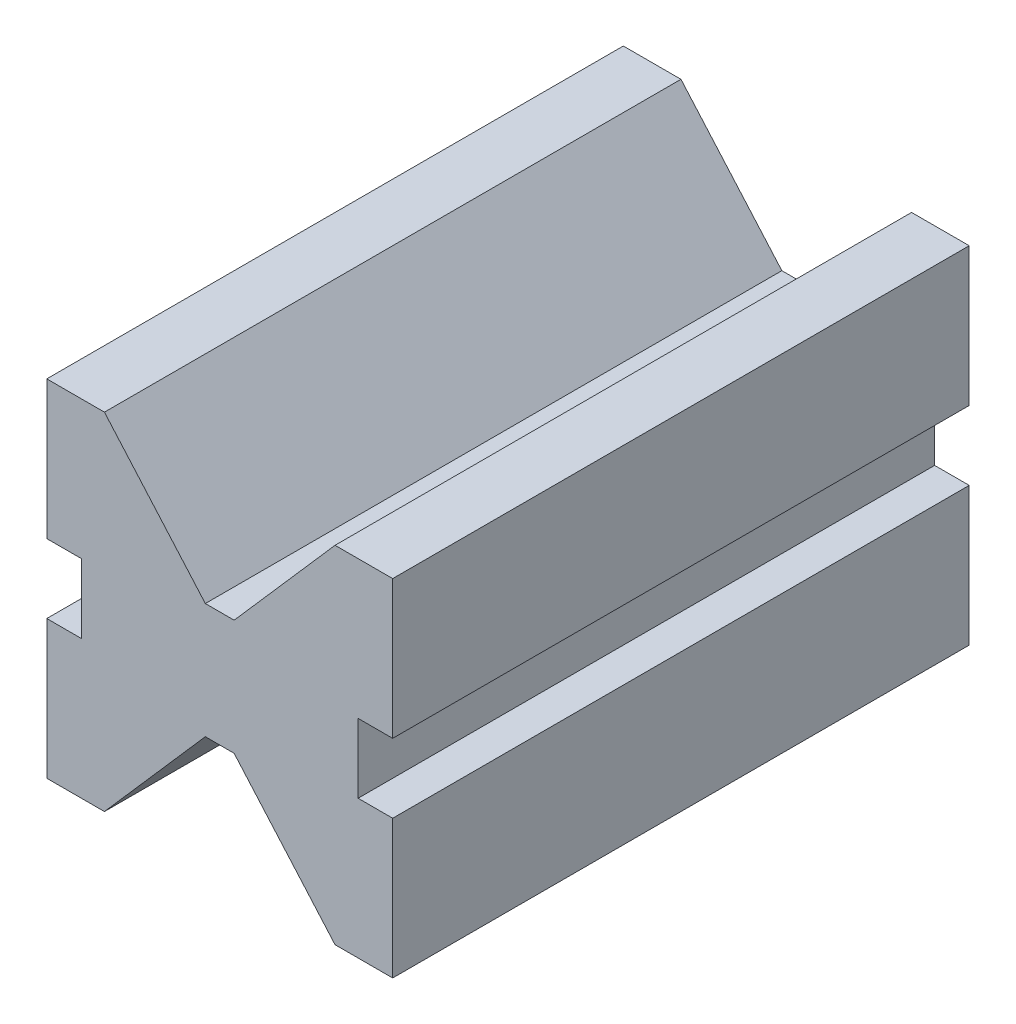
ISO-10303-21;
HEADER;
FILE_DESCRIPTION(('STEP AP214'),'2;1');
FILE_NAME('part.step','',(''),(''),'','','');
FILE_SCHEMA(('AUTOMOTIVE_DESIGN { 1 0 10303 214 1 1 1 1 }'));
ENDSEC;
DATA;
#1=APPLICATION_CONTEXT('core data for automotive mechanical design processes');
#2=APPLICATION_PROTOCOL_DEFINITION('international standard','automotive_design',2000,#1);
#3=PRODUCT_CONTEXT('',#1,'mechanical');
#4=PRODUCT('Part','Part','',(#3));
#5=PRODUCT_RELATED_PRODUCT_CATEGORY('part','',(#4));
#6=PRODUCT_DEFINITION_FORMATION('','',#4);
#7=PRODUCT_DEFINITION_CONTEXT('part definition',#1,'design');
#8=PRODUCT_DEFINITION('design','',#6,#7);
#9=PRODUCT_DEFINITION_SHAPE('','',#8);
#10=(LENGTH_UNIT() NAMED_UNIT(*) SI_UNIT(.MILLI.,.METRE.));
#11=(NAMED_UNIT(*) PLANE_ANGLE_UNIT() SI_UNIT($,.RADIAN.));
#12=(NAMED_UNIT(*) SI_UNIT($,.STERADIAN.) SOLID_ANGLE_UNIT());
#13=UNCERTAINTY_MEASURE_WITH_UNIT(LENGTH_MEASURE(1.E-05),#10,'distance_accuracy_value','');
#14=(GEOMETRIC_REPRESENTATION_CONTEXT(3) GLOBAL_UNCERTAINTY_ASSIGNED_CONTEXT((#13)) GLOBAL_UNIT_ASSIGNED_CONTEXT((#10,
#11,#12)) REPRESENTATION_CONTEXT('',''));
#15=CARTESIAN_POINT('',(0.,0.,0.));
#16=DIRECTION('',(0.,0.,1.));
#17=DIRECTION('',(1.,0.,0.));
#18=AXIS2_PLACEMENT_3D('',#15,#16,#17);
#19=CARTESIAN_POINT('',(0.,24.,100.));
#20=DIRECTION('',(1.,0.,0.));
#21=DIRECTION('',(0.,1.,0.));
#22=AXIS2_PLACEMENT_3D('',#19,#20,#21);
#23=PLANE('',#22);
#24=DIRECTION('',(0.,-1.,0.));
#25=VECTOR('',#24,1.);
#26=CARTESIAN_POINT('',(0.,24.,0.));
#27=LINE('',#26,#25);
#28=CARTESIAN_POINT('',(0.,24.,0.));
#29=VERTEX_POINT('',#28);
#30=CARTESIAN_POINT('',(0.,0.,0.));
#31=VERTEX_POINT('',#30);
#32=EDGE_CURVE('E212',#29,#31,#27,.T.);
#33=ORIENTED_EDGE('',*,*,#32,.T.);
#34=DIRECTION('',(0.,0.,-1.));
#35=VECTOR('',#34,1.);
#36=CARTESIAN_POINT('',(0.,0.,100.));
#37=LINE('',#36,#35);
#38=CARTESIAN_POINT('',(0.,0.,100.));
#39=VERTEX_POINT('',#38);
#40=EDGE_CURVE('E11',#39,#31,#37,.T.);
#41=ORIENTED_EDGE('',*,*,#40,.F.);
#42=DIRECTION('',(0.,-1.,0.));
#43=VECTOR('',#42,1.);
#44=CARTESIAN_POINT('',(0.,24.,100.));
#45=LINE('',#44,#43);
#46=CARTESIAN_POINT('',(0.,24.,100.));
#47=VERTEX_POINT('',#46);
#48=EDGE_CURVE('E270',#47,#39,#45,.T.);
#49=ORIENTED_EDGE('',*,*,#48,.F.);
#50=DIRECTION('',(0.,0.,-1.));
#51=VECTOR('',#50,1.);
#52=CARTESIAN_POINT('',(0.,24.,100.));
#53=LINE('',#52,#51);
#54=EDGE_CURVE('E208',#47,#29,#53,.T.);
#55=ORIENTED_EDGE('',*,*,#54,.T.);
#56=EDGE_LOOP('',(#33,#41,#49,#55));
#57=FACE_BOUND('',#56,.T.);
#58=ADVANCED_FACE('F39',(#57),#23,.F.);
#59=CARTESIAN_POINT('',(0.,0.,100.));
#60=DIRECTION('',(0.,1.,0.));
#61=DIRECTION('',(0.,0.,1.));
#62=AXIS2_PLACEMENT_3D('',#59,#60,#61);
#63=PLANE('',#62);
#64=DIRECTION('',(1.,0.,0.));
#65=VECTOR('',#64,1.);
#66=CARTESIAN_POINT('',(0.,0.,0.));
#67=LINE('',#66,#65);
#68=CARTESIAN_POINT('',(10.,0.,0.));
#69=VERTEX_POINT('',#68);
#70=EDGE_CURVE('E216',#31,#69,#67,.T.);
#71=ORIENTED_EDGE('',*,*,#70,.T.);
#72=DIRECTION('',(0.,0.,-1.));
#73=VECTOR('',#72,1.);
#74=CARTESIAN_POINT('',(10.,0.,100.));
#75=LINE('',#74,#73);
#76=CARTESIAN_POINT('',(10.,0.,100.));
#77=VERTEX_POINT('',#76);
#78=EDGE_CURVE('E48',#77,#69,#75,.T.);
#79=ORIENTED_EDGE('',*,*,#78,.F.);
#80=DIRECTION('',(1.,0.,0.));
#81=VECTOR('',#80,1.);
#82=CARTESIAN_POINT('',(0.,0.,100.));
#83=LINE('',#82,#81);
#84=EDGE_CURVE('E135',#39,#77,#83,.T.);
#85=ORIENTED_EDGE('',*,*,#84,.F.);
#86=ORIENTED_EDGE('',*,*,#40,.T.);
#87=EDGE_LOOP('',(#71,#79,#85,#86));
#88=FACE_BOUND('',#87,.T.);
#89=ADVANCED_FACE('F420',(#88),#63,.F.);
#90=CARTESIAN_POINT('',(10.,0.,100.));
#91=DIRECTION('',(-0.752576694706878,0.658504607868518,0.));
#92=DIRECTION('',(-0.658504607868518,-0.752576694706878,0.));
#93=AXIS2_PLACEMENT_3D('',#90,#91,#92);
#94=PLANE('',#93);
#95=DIRECTION('',(0.658504607868518,0.752576694706878,0.));
#96=VECTOR('',#95,1.);
#97=CARTESIAN_POINT('',(10.,0.,0.));
#98=LINE('',#97,#96);
#99=CARTESIAN_POINT('',(27.5,20.,0.));
#100=VERTEX_POINT('',#99);
#101=EDGE_CURVE('E219',#69,#100,#98,.T.);
#102=ORIENTED_EDGE('',*,*,#101,.T.);
#103=DIRECTION('',(0.,0.,-1.));
#104=VECTOR('',#103,1.);
#105=CARTESIAN_POINT('',(27.5,20.,100.));
#106=LINE('',#105,#104);
#107=CARTESIAN_POINT('',(27.5,20.,100.));
#108=VERTEX_POINT('',#107);
#109=EDGE_CURVE('E329',#108,#100,#106,.T.);
#110=ORIENTED_EDGE('',*,*,#109,.F.);
#111=DIRECTION('',(0.658504607868518,0.752576694706878,0.));
#112=VECTOR('',#111,1.);
#113=CARTESIAN_POINT('',(10.,0.,100.));
#114=LINE('',#113,#112);
#115=EDGE_CURVE('E339',#77,#108,#114,.T.);
#116=ORIENTED_EDGE('',*,*,#115,.F.);
#117=ORIENTED_EDGE('',*,*,#78,.T.);
#118=EDGE_LOOP('',(#102,#110,#116,#117));
#119=FACE_BOUND('',#118,.T.);
#120=ADVANCED_FACE('F337',(#119),#94,.F.);
#121=CARTESIAN_POINT('',(27.5,20.,100.));
#122=DIRECTION('',(0.,1.,0.));
#123=DIRECTION('',(0.,0.,1.));
#124=AXIS2_PLACEMENT_3D('',#121,#122,#123);
#125=PLANE('',#124);
#126=DIRECTION('',(1.,0.,0.));
#127=VECTOR('',#126,1.);
#128=CARTESIAN_POINT('',(27.5,20.,0.));
#129=LINE('',#128,#127);
#130=CARTESIAN_POINT('',(32.5,20.,0.));
#131=VERTEX_POINT('',#130);
#132=EDGE_CURVE('E222',#100,#131,#129,.T.);
#133=ORIENTED_EDGE('',*,*,#132,.T.);
#134=DIRECTION('',(0.,0.,-1.));
#135=VECTOR('',#134,1.);
#136=CARTESIAN_POINT('',(32.5,20.,100.));
#137=LINE('',#136,#135);
#138=CARTESIAN_POINT('',(32.5,20.,100.));
#139=VERTEX_POINT('',#138);
#140=EDGE_CURVE('E325',#139,#131,#137,.T.);
#141=ORIENTED_EDGE('',*,*,#140,.F.);
#142=DIRECTION('',(1.,0.,0.));
#143=VECTOR('',#142,1.);
#144=CARTESIAN_POINT('',(27.5,20.,100.));
#145=LINE('',#144,#143);
#146=EDGE_CURVE('E358',#108,#139,#145,.T.);
#147=ORIENTED_EDGE('',*,*,#146,.F.);
#148=ORIENTED_EDGE('',*,*,#109,.T.);
#149=EDGE_LOOP('',(#133,#141,#147,#148));
#150=FACE_BOUND('',#149,.T.);
#151=ADVANCED_FACE('F348',(#150),#125,.F.);
#152=CARTESIAN_POINT('',(32.5,20.,100.));
#153=DIRECTION('',(0.752576694706878,0.658504607868518,0.));
#154=DIRECTION('',(-0.658504607868518,0.752576694706878,0.));
#155=AXIS2_PLACEMENT_3D('',#152,#153,#154);
#156=PLANE('',#155);
#157=DIRECTION('',(0.658504607868518,-0.752576694706878,0.));
#158=VECTOR('',#157,1.);
#159=CARTESIAN_POINT('',(32.5,20.,0.));
#160=LINE('',#159,#158);
#161=CARTESIAN_POINT('',(50.,0.,0.));
#162=VERTEX_POINT('',#161);
#163=EDGE_CURVE('E225',#131,#162,#160,.T.);
#164=ORIENTED_EDGE('',*,*,#163,.T.);
#165=DIRECTION('',(0.,0.,-1.));
#166=VECTOR('',#165,1.);
#167=CARTESIAN_POINT('',(50.,0.,100.));
#168=LINE('',#167,#166);
#169=CARTESIAN_POINT('',(50.,0.,100.));
#170=VERTEX_POINT('',#169);
#171=EDGE_CURVE('E321',#170,#162,#168,.T.);
#172=ORIENTED_EDGE('',*,*,#171,.F.);
#173=DIRECTION('',(0.658504607868518,-0.752576694706878,0.));
#174=VECTOR('',#173,1.);
#175=CARTESIAN_POINT('',(32.5,20.,100.));
#176=LINE('',#175,#174);
#177=EDGE_CURVE('E354',#139,#170,#176,.T.);
#178=ORIENTED_EDGE('',*,*,#177,.F.);
#179=ORIENTED_EDGE('',*,*,#140,.T.);
#180=EDGE_LOOP('',(#164,#172,#178,#179));
#181=FACE_BOUND('',#180,.T.);
#182=ADVANCED_FACE('F352',(#181),#156,.F.);
#183=CARTESIAN_POINT('',(50.,0.,100.));
#184=DIRECTION('',(0.,1.,0.));
#185=DIRECTION('',(0.,0.,1.));
#186=AXIS2_PLACEMENT_3D('',#183,#184,#185);
#187=PLANE('',#186);
#188=DIRECTION('',(1.,0.,0.));
#189=VECTOR('',#188,1.);
#190=CARTESIAN_POINT('',(50.,0.,0.));
#191=LINE('',#190,#189);
#192=CARTESIAN_POINT('',(60.,0.,0.));
#193=VERTEX_POINT('',#192);
#194=EDGE_CURVE('E228',#162,#193,#191,.T.);
#195=ORIENTED_EDGE('',*,*,#194,.T.);
#196=DIRECTION('',(0.,0.,-1.));
#197=VECTOR('',#196,1.);
#198=CARTESIAN_POINT('',(60.,0.,100.));
#199=LINE('',#198,#197);
#200=CARTESIAN_POINT('',(60.,0.,100.));
#201=VERTEX_POINT('',#200);
#202=EDGE_CURVE('E317',#201,#193,#199,.T.);
#203=ORIENTED_EDGE('',*,*,#202,.F.);
#204=DIRECTION('',(1.,0.,0.));
#205=VECTOR('',#204,1.);
#206=CARTESIAN_POINT('',(50.,0.,100.));
#207=LINE('',#206,#205);
#208=EDGE_CURVE('E357',#170,#201,#207,.T.);
#209=ORIENTED_EDGE('',*,*,#208,.F.);
#210=ORIENTED_EDGE('',*,*,#171,.T.);
#211=EDGE_LOOP('',(#195,#203,#209,#210));
#212=FACE_BOUND('',#211,.T.);
#213=ADVANCED_FACE('F433',(#212),#187,.F.);
#214=CARTESIAN_POINT('',(60.,0.,100.));
#215=DIRECTION('',(-1.,0.,0.));
#216=DIRECTION('',(0.,-1.,0.));
#217=AXIS2_PLACEMENT_3D('',#214,#215,#216);
#218=PLANE('',#217);
#219=DIRECTION('',(0.,1.,0.));
#220=VECTOR('',#219,1.);
#221=CARTESIAN_POINT('',(60.,0.,0.));
#222=LINE('',#221,#220);
#223=CARTESIAN_POINT('',(60.,24.,0.));
#224=VERTEX_POINT('',#223);
#225=EDGE_CURVE('E231',#193,#224,#222,.T.);
#226=ORIENTED_EDGE('',*,*,#225,.T.);
#227=DIRECTION('',(0.,0.,-1.));
#228=VECTOR('',#227,1.);
#229=CARTESIAN_POINT('',(60.,24.,100.));
#230=LINE('',#229,#228);
#231=CARTESIAN_POINT('',(60.,24.,100.));
#232=VERTEX_POINT('',#231);
#233=EDGE_CURVE('E313',#232,#224,#230,.T.);
#234=ORIENTED_EDGE('',*,*,#233,.F.);
#235=DIRECTION('',(0.,1.,0.));
#236=VECTOR('',#235,1.);
#237=CARTESIAN_POINT('',(60.,0.,100.));
#238=LINE('',#237,#236);
#239=EDGE_CURVE('E362',#201,#232,#238,.T.);
#240=ORIENTED_EDGE('',*,*,#239,.F.);
#241=ORIENTED_EDGE('',*,*,#202,.T.);
#242=EDGE_LOOP('',(#226,#234,#240,#241));
#243=FACE_BOUND('',#242,.T.);
#244=ADVANCED_FACE('F436',(#243),#218,.F.);
#245=CARTESIAN_POINT('',(60.,24.,100.));
#246=DIRECTION('',(0.,-1.,0.));
#247=DIRECTION('',(0.,0.,-1.));
#248=AXIS2_PLACEMENT_3D('',#245,#246,#247);
#249=PLANE('',#248);
#250=DIRECTION('',(-1.,0.,0.));
#251=VECTOR('',#250,1.);
#252=CARTESIAN_POINT('',(60.,24.,0.));
#253=LINE('',#252,#251);
#254=CARTESIAN_POINT('',(54.,24.,0.));
#255=VERTEX_POINT('',#254);
#256=EDGE_CURVE('E234',#224,#255,#253,.T.);
#257=ORIENTED_EDGE('',*,*,#256,.T.);
#258=DIRECTION('',(0.,0.,-1.));
#259=VECTOR('',#258,1.);
#260=CARTESIAN_POINT('',(54.,24.,100.));
#261=LINE('',#260,#259);
#262=CARTESIAN_POINT('',(54.,24.,100.));
#263=VERTEX_POINT('',#262);
#264=EDGE_CURVE('E309',#263,#255,#261,.T.);
#265=ORIENTED_EDGE('',*,*,#264,.F.);
#266=DIRECTION('',(-1.,0.,0.));
#267=VECTOR('',#266,1.);
#268=CARTESIAN_POINT('',(60.,24.,100.));
#269=LINE('',#268,#267);
#270=EDGE_CURVE('E369',#232,#263,#269,.T.);
#271=ORIENTED_EDGE('',*,*,#270,.F.);
#272=ORIENTED_EDGE('',*,*,#233,.T.);
#273=EDGE_LOOP('',(#257,#265,#271,#272));
#274=FACE_BOUND('',#273,.T.);
#275=ADVANCED_FACE('F440',(#274),#249,.F.);
#276=CARTESIAN_POINT('',(54.,24.,100.));
#277=DIRECTION('',(-1.,0.,0.));
#278=DIRECTION('',(0.,0.,1.));
#279=AXIS2_PLACEMENT_3D('',#276,#277,#278);
#280=PLANE('',#279);
#281=DIRECTION('',(0.,1.,0.));
#282=VECTOR('',#281,1.);
#283=CARTESIAN_POINT('',(54.,24.,0.));
#284=LINE('',#283,#282);
#285=CARTESIAN_POINT('',(54.,36.,0.));
#286=VERTEX_POINT('',#285);
#287=EDGE_CURVE('E237',#255,#286,#284,.T.);
#288=ORIENTED_EDGE('',*,*,#287,.T.);
#289=DIRECTION('',(0.,0.,-1.));
#290=VECTOR('',#289,1.);
#291=CARTESIAN_POINT('',(54.,36.,100.));
#292=LINE('',#291,#290);
#293=CARTESIAN_POINT('',(54.,36.,100.));
#294=VERTEX_POINT('',#293);
#295=EDGE_CURVE('E305',#294,#286,#292,.T.);
#296=ORIENTED_EDGE('',*,*,#295,.F.);
#297=DIRECTION('',(0.,1.,0.));
#298=VECTOR('',#297,1.);
#299=CARTESIAN_POINT('',(54.,24.,100.));
#300=LINE('',#299,#298);
#301=EDGE_CURVE('E372',#263,#294,#300,.T.);
#302=ORIENTED_EDGE('',*,*,#301,.F.);
#303=ORIENTED_EDGE('',*,*,#264,.T.);
#304=EDGE_LOOP('',(#288,#296,#302,#303));
#305=FACE_BOUND('',#304,.T.);
#306=ADVANCED_FACE('F444',(#305),#280,.F.);
#307=CARTESIAN_POINT('',(54.,36.,100.));
#308=DIRECTION('',(0.,1.,0.));
#309=DIRECTION('',(-1.,0.,0.));
#310=AXIS2_PLACEMENT_3D('',#307,#308,#309);
#311=PLANE('',#310);
#312=DIRECTION('',(1.,0.,0.));
#313=VECTOR('',#312,1.);
#314=CARTESIAN_POINT('',(54.,36.,0.));
#315=LINE('',#314,#313);
#316=CARTESIAN_POINT('',(60.,36.,0.));
#317=VERTEX_POINT('',#316);
#318=EDGE_CURVE('E240',#286,#317,#315,.T.);
#319=ORIENTED_EDGE('',*,*,#318,.T.);
#320=DIRECTION('',(0.,0.,-1.));
#321=VECTOR('',#320,1.);
#322=CARTESIAN_POINT('',(60.,36.,100.));
#323=LINE('',#322,#321);
#324=CARTESIAN_POINT('',(60.,36.,100.));
#325=VERTEX_POINT('',#324);
#326=EDGE_CURVE('E301',#325,#317,#323,.T.);
#327=ORIENTED_EDGE('',*,*,#326,.F.);
#328=DIRECTION('',(1.,0.,0.));
#329=VECTOR('',#328,1.);
#330=CARTESIAN_POINT('',(54.,36.,100.));
#331=LINE('',#330,#329);
#332=EDGE_CURVE('E375',#294,#325,#331,.T.);
#333=ORIENTED_EDGE('',*,*,#332,.F.);
#334=ORIENTED_EDGE('',*,*,#295,.T.);
#335=EDGE_LOOP('',(#319,#327,#333,#334));
#336=FACE_BOUND('',#335,.T.);
#337=ADVANCED_FACE('F448',(#336),#311,.F.);
#338=CARTESIAN_POINT('',(60.,36.,100.));
#339=DIRECTION('',(-1.,0.,0.));
#340=DIRECTION('',(0.,0.,1.));
#341=AXIS2_PLACEMENT_3D('',#338,#339,#340);
#342=PLANE('',#341);
#343=DIRECTION('',(0.,1.,0.));
#344=VECTOR('',#343,1.);
#345=CARTESIAN_POINT('',(60.,36.,0.));
#346=LINE('',#345,#344);
#347=CARTESIAN_POINT('',(60.,60.,0.));
#348=VERTEX_POINT('',#347);
#349=EDGE_CURVE('E243',#317,#348,#346,.T.);
#350=ORIENTED_EDGE('',*,*,#349,.T.);
#351=DIRECTION('',(0.,0.,-1.));
#352=VECTOR('',#351,1.);
#353=CARTESIAN_POINT('',(60.,60.,100.));
#354=LINE('',#353,#352);
#355=CARTESIAN_POINT('',(60.,60.,100.));
#356=VERTEX_POINT('',#355);
#357=EDGE_CURVE('E297',#356,#348,#354,.T.);
#358=ORIENTED_EDGE('',*,*,#357,.F.);
#359=DIRECTION('',(0.,1.,0.));
#360=VECTOR('',#359,1.);
#361=CARTESIAN_POINT('',(60.,36.,100.));
#362=LINE('',#361,#360);
#363=EDGE_CURVE('E378',#325,#356,#362,.T.);
#364=ORIENTED_EDGE('',*,*,#363,.F.);
#365=ORIENTED_EDGE('',*,*,#326,.T.);
#366=EDGE_LOOP('',(#350,#358,#364,#365));
#367=FACE_BOUND('',#366,.T.);
#368=ADVANCED_FACE('F452',(#367),#342,.F.);
#369=CARTESIAN_POINT('',(60.,60.,100.));
#370=DIRECTION('',(0.,-1.,0.));
#371=DIRECTION('',(0.,0.,-1.));
#372=AXIS2_PLACEMENT_3D('',#369,#370,#371);
#373=PLANE('',#372);
#374=DIRECTION('',(-1.,0.,0.));
#375=VECTOR('',#374,1.);
#376=CARTESIAN_POINT('',(60.,60.,0.));
#377=LINE('',#376,#375);
#378=CARTESIAN_POINT('',(50.,60.,0.));
#379=VERTEX_POINT('',#378);
#380=EDGE_CURVE('E246',#348,#379,#377,.T.);
#381=ORIENTED_EDGE('',*,*,#380,.T.);
#382=DIRECTION('',(0.,0.,-1.));
#383=VECTOR('',#382,1.);
#384=CARTESIAN_POINT('',(50.,60.,100.));
#385=LINE('',#384,#383);
#386=CARTESIAN_POINT('',(50.,60.,100.));
#387=VERTEX_POINT('',#386);
#388=EDGE_CURVE('E293',#387,#379,#385,.T.);
#389=ORIENTED_EDGE('',*,*,#388,.F.);
#390=DIRECTION('',(-1.,0.,0.));
#391=VECTOR('',#390,1.);
#392=CARTESIAN_POINT('',(60.,60.,100.));
#393=LINE('',#392,#391);
#394=EDGE_CURVE('E381',#356,#387,#393,.T.);
#395=ORIENTED_EDGE('',*,*,#394,.F.);
#396=ORIENTED_EDGE('',*,*,#357,.T.);
#397=EDGE_LOOP('',(#381,#389,#395,#396));
#398=FACE_BOUND('',#397,.T.);
#399=ADVANCED_FACE('F456',(#398),#373,.F.);
#400=CARTESIAN_POINT('',(50.,60.,100.));
#401=DIRECTION('',(0.752576694706878,-0.658504607868517,0.));
#402=DIRECTION('',(0.658504607868517,0.752576694706878,0.));
#403=AXIS2_PLACEMENT_3D('',#400,#401,#402);
#404=PLANE('',#403);
#405=DIRECTION('',(-0.658504607868517,-0.752576694706878,0.));
#406=VECTOR('',#405,1.);
#407=CARTESIAN_POINT('',(50.,60.,0.));
#408=LINE('',#407,#406);
#409=CARTESIAN_POINT('',(32.5,40.,0.));
#410=VERTEX_POINT('',#409);
#411=EDGE_CURVE('E249',#379,#410,#408,.T.);
#412=ORIENTED_EDGE('',*,*,#411,.T.);
#413=DIRECTION('',(0.,0.,-1.));
#414=VECTOR('',#413,1.);
#415=CARTESIAN_POINT('',(32.5,40.,100.));
#416=LINE('',#415,#414);
#417=CARTESIAN_POINT('',(32.5,40.,100.));
#418=VERTEX_POINT('',#417);
#419=EDGE_CURVE('E289',#418,#410,#416,.T.);
#420=ORIENTED_EDGE('',*,*,#419,.F.);
#421=DIRECTION('',(-0.658504607868517,-0.752576694706878,0.));
#422=VECTOR('',#421,1.);
#423=CARTESIAN_POINT('',(50.,60.,100.));
#424=LINE('',#423,#422);
#425=EDGE_CURVE('E384',#387,#418,#424,.T.);
#426=ORIENTED_EDGE('',*,*,#425,.F.);
#427=ORIENTED_EDGE('',*,*,#388,.T.);
#428=EDGE_LOOP('',(#412,#420,#426,#427));
#429=FACE_BOUND('',#428,.T.);
#430=ADVANCED_FACE('F460',(#429),#404,.F.);
#431=CARTESIAN_POINT('',(27.5,40.,100.));
#432=DIRECTION('',(0.,-1.,0.));
#433=DIRECTION('',(1.,0.,0.));
#434=AXIS2_PLACEMENT_3D('',#431,#432,#433);
#435=PLANE('',#434);
#436=DIRECTION('',(-1.,0.,0.));
#437=VECTOR('',#436,1.);
#438=CARTESIAN_POINT('',(27.5,40.,0.));
#439=LINE('',#438,#437);
#440=CARTESIAN_POINT('',(27.5,40.,0.));
#441=VERTEX_POINT('',#440);
#442=EDGE_CURVE('E252',#410,#441,#439,.T.);
#443=ORIENTED_EDGE('',*,*,#442,.T.);
#444=DIRECTION('',(0.,0.,-1.));
#445=VECTOR('',#444,1.);
#446=CARTESIAN_POINT('',(27.5,40.,100.));
#447=LINE('',#446,#445);
#448=CARTESIAN_POINT('',(27.5,40.,100.));
#449=VERTEX_POINT('',#448);
#450=EDGE_CURVE('E285',#449,#441,#447,.T.);
#451=ORIENTED_EDGE('',*,*,#450,.F.);
#452=DIRECTION('',(-1.,0.,0.));
#453=VECTOR('',#452,1.);
#454=CARTESIAN_POINT('',(27.5,40.,100.));
#455=LINE('',#454,#453);
#456=EDGE_CURVE('E387',#418,#449,#455,.T.);
#457=ORIENTED_EDGE('',*,*,#456,.F.);
#458=ORIENTED_EDGE('',*,*,#419,.T.);
#459=EDGE_LOOP('',(#443,#451,#457,#458));
#460=FACE_BOUND('',#459,.T.);
#461=ADVANCED_FACE('F464',(#460),#435,.F.);
#462=CARTESIAN_POINT('',(27.5,40.,100.));
#463=DIRECTION('',(-0.752576694706878,-0.658504607868518,0.));
#464=DIRECTION('',(0.658504607868518,-0.752576694706878,0.));
#465=AXIS2_PLACEMENT_3D('',#462,#463,#464);
#466=PLANE('',#465);
#467=DIRECTION('',(-0.658504607868518,0.752576694706878,0.));
#468=VECTOR('',#467,1.);
#469=CARTESIAN_POINT('',(27.5,40.,0.));
#470=LINE('',#469,#468);
#471=CARTESIAN_POINT('',(10.,60.,0.));
#472=VERTEX_POINT('',#471);
#473=EDGE_CURVE('E255',#441,#472,#470,.T.);
#474=ORIENTED_EDGE('',*,*,#473,.T.);
#475=DIRECTION('',(0.,0.,-1.));
#476=VECTOR('',#475,1.);
#477=CARTESIAN_POINT('',(10.,60.,100.));
#478=LINE('',#477,#476);
#479=CARTESIAN_POINT('',(10.,60.,100.));
#480=VERTEX_POINT('',#479);
#481=EDGE_CURVE('E281',#480,#472,#478,.T.);
#482=ORIENTED_EDGE('',*,*,#481,.F.);
#483=DIRECTION('',(-0.658504607868518,0.752576694706878,0.));
#484=VECTOR('',#483,1.);
#485=CARTESIAN_POINT('',(27.5,40.,100.));
#486=LINE('',#485,#484);
#487=EDGE_CURVE('E390',#449,#480,#486,.T.);
#488=ORIENTED_EDGE('',*,*,#487,.F.);
#489=ORIENTED_EDGE('',*,*,#450,.T.);
#490=EDGE_LOOP('',(#474,#482,#488,#489));
#491=FACE_BOUND('',#490,.T.);
#492=ADVANCED_FACE('F468',(#491),#466,.F.);
#493=CARTESIAN_POINT('',(10.,60.,100.));
#494=DIRECTION('',(0.,-1.,0.));
#495=DIRECTION('',(0.,0.,-1.));
#496=AXIS2_PLACEMENT_3D('',#493,#494,#495);
#497=PLANE('',#496);
#498=DIRECTION('',(-1.,0.,0.));
#499=VECTOR('',#498,1.);
#500=CARTESIAN_POINT('',(10.,60.,0.));
#501=LINE('',#500,#499);
#502=CARTESIAN_POINT('',(0.,60.,0.));
#503=VERTEX_POINT('',#502);
#504=EDGE_CURVE('E258',#472,#503,#501,.T.);
#505=ORIENTED_EDGE('',*,*,#504,.T.);
#506=DIRECTION('',(0.,0.,-1.));
#507=VECTOR('',#506,1.);
#508=CARTESIAN_POINT('',(0.,60.,100.));
#509=LINE('',#508,#507);
#510=CARTESIAN_POINT('',(0.,60.,100.));
#511=VERTEX_POINT('',#510);
#512=EDGE_CURVE('E277',#511,#503,#509,.T.);
#513=ORIENTED_EDGE('',*,*,#512,.F.);
#514=DIRECTION('',(-1.,0.,0.));
#515=VECTOR('',#514,1.);
#516=CARTESIAN_POINT('',(10.,60.,100.));
#517=LINE('',#516,#515);
#518=EDGE_CURVE('E393',#480,#511,#517,.T.);
#519=ORIENTED_EDGE('',*,*,#518,.F.);
#520=ORIENTED_EDGE('',*,*,#481,.T.);
#521=EDGE_LOOP('',(#505,#513,#519,#520));
#522=FACE_BOUND('',#521,.T.);
#523=ADVANCED_FACE('F401',(#522),#497,.F.);
#524=CARTESIAN_POINT('',(0.,60.,100.));
#525=DIRECTION('',(1.,0.,0.));
#526=DIRECTION('',(0.,1.,0.));
#527=AXIS2_PLACEMENT_3D('',#524,#525,#526);
#528=PLANE('',#527);
#529=DIRECTION('',(0.,-1.,0.));
#530=VECTOR('',#529,1.);
#531=CARTESIAN_POINT('',(0.,60.,0.));
#532=LINE('',#531,#530);
#533=CARTESIAN_POINT('',(0.,36.,0.));
#534=VERTEX_POINT('',#533);
#535=EDGE_CURVE('E261',#503,#534,#532,.T.);
#536=ORIENTED_EDGE('',*,*,#535,.T.);
#537=DIRECTION('',(0.,0.,-1.));
#538=VECTOR('',#537,1.);
#539=CARTESIAN_POINT('',(0.,36.,100.));
#540=LINE('',#539,#538);
#541=CARTESIAN_POINT('',(0.,36.,100.));
#542=VERTEX_POINT('',#541);
#543=EDGE_CURVE('E201',#542,#534,#540,.T.);
#544=ORIENTED_EDGE('',*,*,#543,.F.);
#545=DIRECTION('',(0.,-1.,0.));
#546=VECTOR('',#545,1.);
#547=CARTESIAN_POINT('',(0.,60.,100.));
#548=LINE('',#547,#546);
#549=EDGE_CURVE('E190',#511,#542,#548,.T.);
#550=ORIENTED_EDGE('',*,*,#549,.F.);
#551=ORIENTED_EDGE('',*,*,#512,.T.);
#552=EDGE_LOOP('',(#536,#544,#550,#551));
#553=FACE_BOUND('',#552,.T.);
#554=ADVANCED_FACE('F405',(#553),#528,.F.);
#555=CARTESIAN_POINT('',(0.,36.,100.));
#556=DIRECTION('',(0.,1.,0.));
#557=DIRECTION('',(0.,0.,1.));
#558=AXIS2_PLACEMENT_3D('',#555,#556,#557);
#559=PLANE('',#558);
#560=DIRECTION('',(1.,0.,0.));
#561=VECTOR('',#560,1.);
#562=CARTESIAN_POINT('',(0.,36.,0.));
#563=LINE('',#562,#561);
#564=CARTESIAN_POINT('',(6.,36.,0.));
#565=VERTEX_POINT('',#564);
#566=EDGE_CURVE('E199',#534,#565,#563,.T.);
#567=ORIENTED_EDGE('',*,*,#566,.T.);
#568=DIRECTION('',(0.,0.,-1.));
#569=VECTOR('',#568,1.);
#570=CARTESIAN_POINT('',(6.,36.,100.));
#571=LINE('',#570,#569);
#572=CARTESIAN_POINT('',(6.,36.,100.));
#573=VERTEX_POINT('',#572);
#574=EDGE_CURVE('E196',#573,#565,#571,.T.);
#575=ORIENTED_EDGE('',*,*,#574,.F.);
#576=DIRECTION('',(1.,0.,0.));
#577=VECTOR('',#576,1.);
#578=CARTESIAN_POINT('',(0.,36.,100.));
#579=LINE('',#578,#577);
#580=EDGE_CURVE('E184',#542,#573,#579,.T.);
#581=ORIENTED_EDGE('',*,*,#580,.F.);
#582=ORIENTED_EDGE('',*,*,#543,.T.);
#583=EDGE_LOOP('',(#567,#575,#581,#582));
#584=FACE_BOUND('',#583,.T.);
#585=ADVANCED_FACE('F197',(#584),#559,.F.);
#586=CARTESIAN_POINT('',(6.,36.,100.));
#587=DIRECTION('',(1.,0.,0.));
#588=DIRECTION('',(0.,1.,0.));
#589=AXIS2_PLACEMENT_3D('',#586,#587,#588);
#590=PLANE('',#589);
#591=DIRECTION('',(0.,-1.,0.));
#592=VECTOR('',#591,1.);
#593=CARTESIAN_POINT('',(6.,36.,0.));
#594=LINE('',#593,#592);
#595=CARTESIAN_POINT('',(6.,24.,0.));
#596=VERTEX_POINT('',#595);
#597=EDGE_CURVE('E121',#565,#596,#594,.T.);
#598=ORIENTED_EDGE('',*,*,#597,.T.);
#599=DIRECTION('',(0.,0.,-1.));
#600=VECTOR('',#599,1.);
#601=CARTESIAN_POINT('',(6.,24.,100.));
#602=LINE('',#601,#600);
#603=CARTESIAN_POINT('',(6.,24.,100.));
#604=VERTEX_POINT('',#603);
#605=EDGE_CURVE('E202',#604,#596,#602,.T.);
#606=ORIENTED_EDGE('',*,*,#605,.F.);
#607=DIRECTION('',(0.,-1.,0.));
#608=VECTOR('',#607,1.);
#609=CARTESIAN_POINT('',(6.,36.,100.));
#610=LINE('',#609,#608);
#611=EDGE_CURVE('E188',#573,#604,#610,.T.);
#612=ORIENTED_EDGE('',*,*,#611,.F.);
#613=ORIENTED_EDGE('',*,*,#574,.T.);
#614=EDGE_LOOP('',(#598,#606,#612,#613));
#615=FACE_BOUND('',#614,.T.);
#616=ADVANCED_FACE('F204',(#615),#590,.F.);
#617=CARTESIAN_POINT('',(6.,24.,100.));
#618=DIRECTION('',(0.,-1.,0.));
#619=DIRECTION('',(0.,0.,-1.));
#620=AXIS2_PLACEMENT_3D('',#617,#618,#619);
#621=PLANE('',#620);
#622=DIRECTION('',(-1.,0.,0.));
#623=VECTOR('',#622,1.);
#624=CARTESIAN_POINT('',(6.,24.,0.));
#625=LINE('',#624,#623);
#626=EDGE_CURVE('E127',#596,#29,#625,.T.);
#627=ORIENTED_EDGE('',*,*,#626,.T.);
#628=ORIENTED_EDGE('',*,*,#54,.F.);
#629=DIRECTION('',(-1.,0.,0.));
#630=VECTOR('',#629,1.);
#631=CARTESIAN_POINT('',(6.,24.,100.));
#632=LINE('',#631,#630);
#633=EDGE_CURVE('E56',#604,#47,#632,.T.);
#634=ORIENTED_EDGE('',*,*,#633,.F.);
#635=ORIENTED_EDGE('',*,*,#605,.T.);
#636=EDGE_LOOP('',(#627,#628,#634,#635));
#637=FACE_BOUND('',#636,.T.);
#638=ADVANCED_FACE('F409',(#637),#621,.F.);
#639=CARTESIAN_POINT('',(0.,0.,100.));
#640=DIRECTION('',(0.,0.,1.));
#641=DIRECTION('',(1.,0.,0.));
#642=AXIS2_PLACEMENT_3D('',#639,#640,#641);
#643=PLANE('',#642);
#644=ORIENTED_EDGE('',*,*,#48,.T.);
#645=ORIENTED_EDGE('',*,*,#84,.T.);
#646=ORIENTED_EDGE('',*,*,#115,.T.);
#647=ORIENTED_EDGE('',*,*,#146,.T.);
#648=ORIENTED_EDGE('',*,*,#177,.T.);
#649=ORIENTED_EDGE('',*,*,#208,.T.);
#650=ORIENTED_EDGE('',*,*,#239,.T.);
#651=ORIENTED_EDGE('',*,*,#270,.T.);
#652=ORIENTED_EDGE('',*,*,#301,.T.);
#653=ORIENTED_EDGE('',*,*,#332,.T.);
#654=ORIENTED_EDGE('',*,*,#363,.T.);
#655=ORIENTED_EDGE('',*,*,#394,.T.);
#656=ORIENTED_EDGE('',*,*,#425,.T.);
#657=ORIENTED_EDGE('',*,*,#456,.T.);
#658=ORIENTED_EDGE('',*,*,#487,.T.);
#659=ORIENTED_EDGE('',*,*,#518,.T.);
#660=ORIENTED_EDGE('',*,*,#549,.T.);
#661=ORIENTED_EDGE('',*,*,#580,.T.);
#662=ORIENTED_EDGE('',*,*,#611,.T.);
#663=ORIENTED_EDGE('',*,*,#633,.T.);
#664=EDGE_LOOP('',(#644,#645,#646,#647,#648,#649,#650,#651,#652,#653,#654,#655,#656,#657,#658,
#659,#660,#661,#662,#663));
#665=FACE_BOUND('',#664,.T.);
#666=ADVANCED_FACE('F186',(#665),#643,.T.);
#667=CARTESIAN_POINT('',(0.,0.,0.));
#668=DIRECTION('',(0.,0.,1.));
#669=DIRECTION('',(1.,0.,0.));
#670=AXIS2_PLACEMENT_3D('',#667,#668,#669);
#671=PLANE('',#670);
#672=ORIENTED_EDGE('',*,*,#32,.F.);
#673=ORIENTED_EDGE('',*,*,#626,.F.);
#674=ORIENTED_EDGE('',*,*,#597,.F.);
#675=ORIENTED_EDGE('',*,*,#566,.F.);
#676=ORIENTED_EDGE('',*,*,#535,.F.);
#677=ORIENTED_EDGE('',*,*,#504,.F.);
#678=ORIENTED_EDGE('',*,*,#473,.F.);
#679=ORIENTED_EDGE('',*,*,#442,.F.);
#680=ORIENTED_EDGE('',*,*,#411,.F.);
#681=ORIENTED_EDGE('',*,*,#380,.F.);
#682=ORIENTED_EDGE('',*,*,#349,.F.);
#683=ORIENTED_EDGE('',*,*,#318,.F.);
#684=ORIENTED_EDGE('',*,*,#287,.F.);
#685=ORIENTED_EDGE('',*,*,#256,.F.);
#686=ORIENTED_EDGE('',*,*,#225,.F.);
#687=ORIENTED_EDGE('',*,*,#194,.F.);
#688=ORIENTED_EDGE('',*,*,#163,.F.);
#689=ORIENTED_EDGE('',*,*,#132,.F.);
#690=ORIENTED_EDGE('',*,*,#101,.F.);
#691=ORIENTED_EDGE('',*,*,#70,.F.);
#692=EDGE_LOOP('',(#672,#673,#674,#675,#676,#677,#678,#679,#680,#681,#682,#683,#684,#685,#686,
#687,#688,#689,#690,#691));
#693=FACE_BOUND('',#692,.T.);
#694=ADVANCED_FACE('F343',(#693),#671,.F.);
#695=CLOSED_SHELL('',(#58,#89,#120,#151,#182,#213,#244,#275,#306,#337,#368,#399,#430,#461,#492,
#523,#554,#585,#616,#638,#666,#694));
#696=MANIFOLD_SOLID_BREP('B2',#695);
#697=ADVANCED_BREP_SHAPE_REPRESENTATION('',(#18,#696),#14);
#698=SHAPE_DEFINITION_REPRESENTATION(#9,#697);
ENDSEC;
END-ISO-10303-21;
